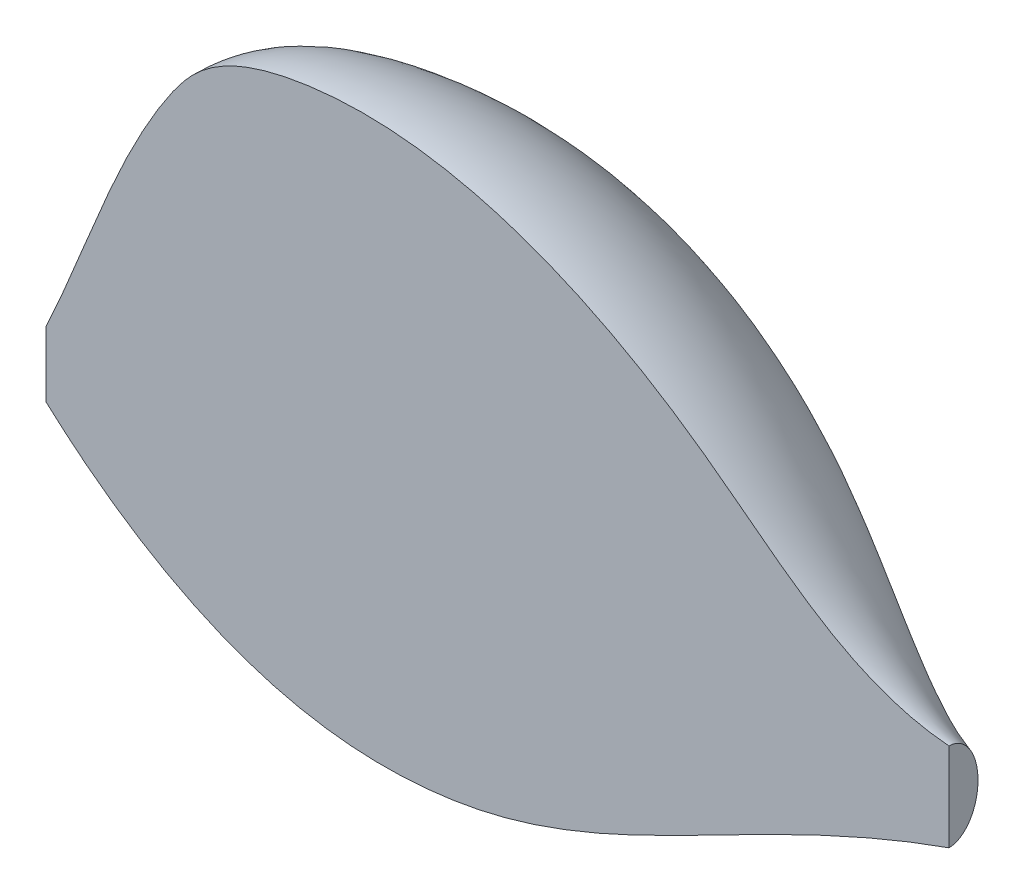
ISO-10303-21;
HEADER;
FILE_DESCRIPTION(('STEP AP214'),'2;1');
FILE_NAME('part.step','',(''),(''),'','','');
FILE_SCHEMA(('AUTOMOTIVE_DESIGN { 1 0 10303 214 1 1 1 1 }'));
ENDSEC;
DATA;
#1=APPLICATION_CONTEXT('core data for automotive mechanical design processes');
#2=APPLICATION_PROTOCOL_DEFINITION('international standard','automotive_design',2000,#1);
#3=PRODUCT_CONTEXT('',#1,'mechanical');
#4=PRODUCT('Part','Part','',(#3));
#5=PRODUCT_RELATED_PRODUCT_CATEGORY('part','',(#4));
#6=PRODUCT_DEFINITION_FORMATION('','',#4);
#7=PRODUCT_DEFINITION_CONTEXT('part definition',#1,'design');
#8=PRODUCT_DEFINITION('design','',#6,#7);
#9=PRODUCT_DEFINITION_SHAPE('','',#8);
#10=(LENGTH_UNIT() NAMED_UNIT(*) SI_UNIT(.MILLI.,.METRE.));
#11=(NAMED_UNIT(*) PLANE_ANGLE_UNIT() SI_UNIT($,.RADIAN.));
#12=(NAMED_UNIT(*) SI_UNIT($,.STERADIAN.) SOLID_ANGLE_UNIT());
#13=UNCERTAINTY_MEASURE_WITH_UNIT(LENGTH_MEASURE(1.E-05),#10,'distance_accuracy_value','');
#14=(GEOMETRIC_REPRESENTATION_CONTEXT(3) GLOBAL_UNCERTAINTY_ASSIGNED_CONTEXT((#13)) GLOBAL_UNIT_ASSIGNED_CONTEXT((#10,
#11,#12)) REPRESENTATION_CONTEXT('',''));
#15=CARTESIAN_POINT('',(0.,0.,0.));
#16=DIRECTION('',(0.,0.,1.));
#17=DIRECTION('',(1.,0.,0.));
#18=AXIS2_PLACEMENT_3D('',#15,#16,#17);
#19=CARTESIAN_POINT('',(0.,0.,0.));
#20=DIRECTION('',(0.,0.,1.));
#21=DIRECTION('',(1.,0.,0.));
#22=AXIS2_PLACEMENT_3D('',#19,#20,#21);
#23=PLANE('',#22);
#24=CARTESIAN_POINT('',(0.,0.,0.));
#25=CARTESIAN_POINT('',(2.74913465416178,5.88162986260912,0.));
#26=CARTESIAN_POINT('',(5.03717500346161,12.96739782815,0.));
#27=CARTESIAN_POINT('',(9.41436775264641,20.1420075056124,0.));
#28=CARTESIAN_POINT('',(10.7979266722041,22.0409358263714,0.));
#29=CARTESIAN_POINT('',(13.7969896713065,24.8764526689348,0.));
#30=CARTESIAN_POINT('',(19.4988240269182,26.5465685835669,0.));
#31=CARTESIAN_POINT('',(25.7105518091795,26.734565554765,0.));
#32=CARTESIAN_POINT('',(30.8570189733681,26.1375032110665,0.));
#33=CARTESIAN_POINT('',(37.3012910290402,24.6226428752955,0.));
#34=CARTESIAN_POINT('',(44.272887864184,21.4438013019915,0.));
#35=CARTESIAN_POINT('',(50.6864894568901,17.2805505945077,0.));
#36=CARTESIAN_POINT('',(58.1055816555101,11.4841674009434,0.));
#37=CARTESIAN_POINT('',(64.0144119849212,7.31487061263528,0.));
#38=CARTESIAN_POINT('',(70.,6.83884738527214,0.));
#39=B_SPLINE_CURVE_WITH_KNOTS('',3,(#24,#25,#26,#27,#28,#29,#30,#31,#32,#33,#34,#35,#36,#37,
#38),.UNSPECIFIED.,.F.,.F.,(4,1,1,1,1,1,1,1,1,1,1,1,4),(0.,0.21875,0.25,0.28125,0.296875,
0.390625,0.46875,0.501412012817861,0.5625,0.6875,0.75,0.8125,1.),.UNSPECIFIED.);
#40=CARTESIAN_POINT('',(0.,0.,0.));
#41=VERTEX_POINT('',#40);
#42=CARTESIAN_POINT('',(70.,6.83884738527214,0.));
#43=VERTEX_POINT('',#42);
#44=EDGE_CURVE('E54',#41,#43,#39,.T.);
#45=ORIENTED_EDGE('',*,*,#44,.F.);
#46=DIRECTION('',(0.,-1.,0.));
#47=VECTOR('',#46,1.);
#48=CARTESIAN_POINT('',(0.,-2.53290643898968,0.));
#49=LINE('',#48,#47);
#50=CARTESIAN_POINT('',(0.,-5.06581287797937,0.));
#51=VERTEX_POINT('',#50);
#52=EDGE_CURVE('E68',#41,#51,#49,.T.);
#53=ORIENTED_EDGE('',*,*,#52,.T.);
#54=CARTESIAN_POINT('',(70.,0.,0.));
#55=CARTESIAN_POINT('',(69.5207540377613,-0.167942416323172,0.));
#56=CARTESIAN_POINT('',(69.04310436203,-0.340383935283861,0.));
#57=CARTESIAN_POINT('',(68.0909932436031,-0.693602987996168,0.));
#58=CARTESIAN_POINT('',(67.6165312416867,-0.874379013409343,0.));
#59=CARTESIAN_POINT('',(66.1964012432734,-1.42880153287223,0.));
#60=CARTESIAN_POINT('',(65.255266067126,-1.81409153508852,0.));
#61=CARTESIAN_POINT('',(63.3840383048807,-2.61069819132023,0.));
#62=CARTESIAN_POINT('',(62.4539468575782,-3.02201750218845,0.));
#63=CARTESIAN_POINT('',(60.6030924066511,-3.86595905883859,0.));
#64=CARTESIAN_POINT('',(59.6823330468258,-4.29858926644618,0.));
#65=CARTESIAN_POINT('',(57.8487837652315,-5.18028391161377,0.));
#66=CARTESIAN_POINT('',(56.9359936083618,-5.62934786231631,0.));
#67=CARTESIAN_POINT('',(55.5720550214034,-6.31135182557194,0.));
#68=CARTESIAN_POINT('',(55.1186880010824,-6.53987886238477,0.));
#69=CARTESIAN_POINT('',(54.2131836867605,-6.99934696524036,0.));
#70=CARTESIAN_POINT('',(53.761046382183,-7.23028801043737,0.));
#71=CARTESIAN_POINT('',(52.8575132169115,-7.69349421456996,0.));
#72=CARTESIAN_POINT('',(52.4061172825027,-7.92575923012507,0.));
#73=CARTESIAN_POINT('',(51.5033541313733,-8.39035111627347,0.));
#74=CARTESIAN_POINT('',(51.0519869148511,-8.6226779872467,0.));
#75=CARTESIAN_POINT('',(49.911075319631,-9.20798420555865,0.));
#76=CARTESIAN_POINT('',(49.2211147211035,-9.56015664172984,0.));
#77=CARTESIAN_POINT('',(47.8373167077115,-10.2568725921749,0.));
#78=CARTESIAN_POINT('',(47.1434792335766,-10.6014159894127,0.));
#79=CARTESIAN_POINT('',(45.7493886971919,-11.2777063862241,0.));
#80=CARTESIAN_POINT('',(45.0491344244958,-11.6094509072914,0.));
#81=CARTESIAN_POINT('',(43.6399633735395,-12.2540422041163,0.));
#82=CARTESIAN_POINT('',(42.931047076047,-12.5668900230192,0.));
#83=CARTESIAN_POINT('',(41.6205360861372,-13.1190704049251,0.));
#84=CARTESIAN_POINT('',(41.0204747824398,-13.3620294732587,0.));
#85=CARTESIAN_POINT('',(39.8125159758704,-13.8278091960158,0.));
#86=CARTESIAN_POINT('',(39.2046180845676,-14.050628847783,0.));
#87=CARTESIAN_POINT('',(37.9808755586177,-14.4722301018851,0.));
#88=CARTESIAN_POINT('',(37.3650360174947,-14.6710263387027,0.));
#89=CARTESIAN_POINT('',(36.4350653861802,-14.9481706385443,0.));
#90=CARTESIAN_POINT('',(36.1240498783241,-15.03704125442,0.));
#91=CARTESIAN_POINT('',(35.4999583695043,-15.2072359069124,0.));
#92=CARTESIAN_POINT('',(35.1868824209709,-15.2885601347667,0.));
#93=CARTESIAN_POINT('',(34.6279912596707,-15.4260313104982,0.));
#94=CARTESIAN_POINT('',(34.3825682493245,-15.4837756384748,0.));
#95=CARTESIAN_POINT('',(33.8905982459604,-15.594240229896,0.));
#96=CARTESIAN_POINT('',(33.6440512572462,-15.6469605125608,0.));
#97=CARTESIAN_POINT('',(32.9028660097002,-15.7975814039828,0.));
#98=CARTESIAN_POINT('',(32.4066730423947,-15.8879446207975,0.));
#99=CARTESIAN_POINT('',(31.4109002133468,-16.0483247258914,0.));
#100=CARTESIAN_POINT('',(30.9113195570331,-16.118336659131,0.));
#101=CARTESIAN_POINT('',(29.9096863157605,-16.2376179397327,0.));
#102=CARTESIAN_POINT('',(29.407633778097,-16.2868876824148,0.));
#103=CARTESIAN_POINT('',(28.435788974684,-16.3615489621274,0.));
#104=CARTESIAN_POINT('',(27.9661030138248,-16.3883260418759,0.));
#105=CARTESIAN_POINT('',(27.0260280470074,-16.4227799515731,0.));
#106=CARTESIAN_POINT('',(26.5556390506514,-16.4304570400531,0.));
#107=CARTESIAN_POINT('',(25.61502835814,-16.4262635127152,0.));
#108=CARTESIAN_POINT('',(25.1448066471109,-16.4143964130142,0.));
#109=CARTESIAN_POINT('',(24.2052820444374,-16.3707606899352,0.));
#110=CARTESIAN_POINT('',(23.7359791505948,-16.3389921142274,0.));
#111=CARTESIAN_POINT('',(22.8188523765266,-16.2570340119344,0.));
#112=CARTESIAN_POINT('',(22.3709543180433,-16.2076743108373,0.));
#113=CARTESIAN_POINT('',(21.4776234428911,-16.0902702438384,0.));
#114=CARTESIAN_POINT('',(21.0321905589695,-16.0222263902499,0.));
#115=CARTESIAN_POINT('',(20.1446313109974,-15.867594929299,0.));
#116=CARTESIAN_POINT('',(19.7025044147517,-15.7810103761426,0.));
#117=CARTESIAN_POINT('',(18.8221949247994,-15.5895435383183,0.));
#118=CARTESIAN_POINT('',(18.384012688654,-15.4846596121328,0.));
#119=CARTESIAN_POINT('',(17.5087070211172,-15.2560285458278,0.));
#120=CARTESIAN_POINT('',(17.0716224372953,-15.1321323274455,0.));
#121=CARTESIAN_POINT('',(16.4200626698991,-14.9330151797095,0.));
#122=CARTESIAN_POINT('',(16.203539115086,-14.8644254636404,0.));
#123=CARTESIAN_POINT('',(15.7719221002057,-14.7228842193273,0.));
#124=CARTESIAN_POINT('',(15.5568286400011,-14.649932691503,0.));
#125=CARTESIAN_POINT('',(14.9135837128089,-14.4246888587275,0.));
#126=CARTESIAN_POINT('',(14.4876362429891,-14.2660589768729,0.));
#127=CARTESIAN_POINT('',(13.6419731085253,-13.933053290886,0.));
#128=CARTESIAN_POINT('',(13.2222573871943,-13.7586776300873,0.));
#129=CARTESIAN_POINT('',(12.3877608472906,-13.3945362183092,0.));
#130=CARTESIAN_POINT('',(11.9730032656278,-13.2047172665379,0.));
#131=CARTESIAN_POINT('',(11.1501455604505,-12.8111776681308,0.));
#132=CARTESIAN_POINT('',(10.7420454578368,-12.6074569778617,0.));
#133=CARTESIAN_POINT('',(9.93279644226536,-12.1868478961428,0.));
#134=CARTESIAN_POINT('',(9.53164611363194,-11.9699622279334,0.));
#135=CARTESIAN_POINT('',(8.73645599040318,-11.5235685576526,0.));
#136=CARTESIAN_POINT('',(8.34241611210433,-11.2940607042972,0.));
#137=CARTESIAN_POINT('',(7.23741293654132,-10.6274651562901,0.));
#138=CARTESIAN_POINT('',(6.53492946969027,-10.1762312830483,0.));
#139=CARTESIAN_POINT('',(5.15481518684846,-9.23725675006452,0.));
#140=CARTESIAN_POINT('',(4.47718686650106,-8.74951243927014,0.));
#141=CARTESIAN_POINT('',(3.15230805096635,-7.74535232933599,0.));
#142=CARTESIAN_POINT('',(2.5048542220024,-7.22920405056081,0.));
#143=CARTESIAN_POINT('',(1.23432665725474,-6.16822203519213,0.));
#144=CARTESIAN_POINT('',(0.611242781818308,-5.62340045491692,0.));
#145=CARTESIAN_POINT('',(0.,-5.06581287797937,0.));
#146=B_SPLINE_CURVE_WITH_KNOTS('',3,(#54,#55,#56,#57,#58,#59,#60,#61,#62,#63,#64,#65,#66,#67,
#68,#69,#70,#71,#72,#73,#74,#75,#76,#77,#78,#79,#80,#81,#82,#83,#84,#85,#86,#87,#88,#89,#90,#91,
#92,#93,#94,#95,#96,#97,#98,#99,#100,#101,#102,#103,#104,#105,#106,#107,#108,#109,#110,#111,
#112,#113,#114,#115,#116,#117,#118,#119,#120,#121,#122,#123,#124,#125,#126,#127,#128,#129,#130,
#131,#132,#133,#134,#135,#136,#137,#138,#139,#140,#141,#142,#143,#144,#145),.UNSPECIFIED.,.F.,
.F.,(4,2,2,2,2,2,2,2,2,2,2,2,2,2,2,2,2,2,2,2,2,2,2,2,2,2,2,2,2,2,2,2,2,2,2,2,2,2,2,2,2,2,2,2,2,
4),(0.,1.52340763460116,3.0465406442945,6.0968668432214,9.14750489754901,12.1992914555054,
15.250987675907,16.7741030020044,18.2972051863515,19.8201454453912,21.343095285754,
23.6670040562815,25.9909484529519,28.3153406461096,30.6396044094961,32.5814466758169,
34.523385565049,36.4641354441031,37.4344490845785,38.4047381290485,39.1610597523311,
39.9173784820914,41.4299837520651,42.9429569965275,44.4559014043125,45.8668757926978,
47.2778310824823,48.6885325606621,50.099230659782,51.4506723628006,52.8020770134254,
54.1532592184395,55.504562691587,56.8670613902098,57.548404881333,58.229748306917,
59.5929636367762,60.9561665585556,62.324282448265,63.6924026322665,65.060240771975,
66.4280627991113,68.931469907158,71.4351276918081,73.9182815511856,76.4003910040779),.UNSPECIFIED.);
#147=CARTESIAN_POINT('',(70.,0.,0.));
#148=VERTEX_POINT('',#147);
#149=EDGE_CURVE('E61',#148,#51,#146,.T.);
#150=ORIENTED_EDGE('',*,*,#149,.F.);
#151=DIRECTION('',(0.,-1.,0.));
#152=VECTOR('',#151,1.);
#153=CARTESIAN_POINT('',(70.,3.41942369263607,0.));
#154=LINE('',#153,#152);
#155=EDGE_CURVE('E66',#43,#148,#154,.T.);
#156=ORIENTED_EDGE('',*,*,#155,.F.);
#157=EDGE_LOOP('',(#45,#53,#150,#156));
#158=FACE_BOUND('',#157,.T.);
#159=ADVANCED_FACE('F34',(#158),#23,.T.);
#160=CARTESIAN_POINT('',(70.,3.41942369263607,0.));
#161=DIRECTION('',(1.,0.,0.));
#162=DIRECTION('',(0.,0.,-1.));
#163=AXIS2_PLACEMENT_3D('',#160,#161,#162);
#164=PLANE('',#163);
#165=CARTESIAN_POINT('',(70.,3.41942369263607,0.));
#166=DIRECTION('',(1.,0.,0.));
#167=DIRECTION('',(0.,1.,0.));
#168=AXIS2_PLACEMENT_3D('',#165,#166,#167);
#169=ELLIPSE('',#168,3.41942369263607,2.25);
#170=EDGE_CURVE('E46',#148,#43,#169,.T.);
#171=ORIENTED_EDGE('',*,*,#170,.T.);
#172=ORIENTED_EDGE('',*,*,#155,.T.);
#173=EDGE_LOOP('',(#171,#172));
#174=FACE_BOUND('',#173,.T.);
#175=ADVANCED_FACE('F72',(#174),#164,.T.);
#176=CARTESIAN_POINT('',(0.,-2.53290643898968,0.));
#177=DIRECTION('',(1.,0.,0.));
#178=DIRECTION('',(0.,0.,-1.));
#179=AXIS2_PLACEMENT_3D('',#176,#177,#178);
#180=PLANE('',#179);
#181=ORIENTED_EDGE('',*,*,#52,.F.);
#182=CARTESIAN_POINT('',(0.,-2.53290643898968,0.));
#183=DIRECTION('',(1.,0.,0.));
#184=DIRECTION('',(0.,1.,0.));
#185=AXIS2_PLACEMENT_3D('',#182,#183,#184);
#186=ELLIPSE('',#185,2.53290643898968,2.5);
#187=EDGE_CURVE('E11',#51,#41,#186,.T.);
#188=ORIENTED_EDGE('',*,*,#187,.F.);
#189=EDGE_LOOP('',(#181,#188));
#190=FACE_BOUND('',#189,.T.);
#191=ADVANCED_FACE('F108',(#190),#180,.F.);
#192=CARTESIAN_POINT('',(0.,0.,0.));
#193=CARTESIAN_POINT('',(2.74913465416178,5.88162986260912,0.));
#194=CARTESIAN_POINT('',(5.03717500346161,12.96739782815,0.));
#195=CARTESIAN_POINT('',(9.41436775264641,20.1420075056124,0.));
#196=CARTESIAN_POINT('',(10.7979266722041,22.0409358263714,0.));
#197=CARTESIAN_POINT('',(13.7969896713065,24.8764526689348,0.));
#198=CARTESIAN_POINT('',(19.4988240269182,26.5465685835669,0.));
#199=CARTESIAN_POINT('',(25.7105518091795,26.734565554765,0.));
#200=CARTESIAN_POINT('',(30.8570189733681,26.1375032110665,0.));
#201=CARTESIAN_POINT('',(37.3012910290402,24.6226428752955,0.));
#202=CARTESIAN_POINT('',(44.272887864184,21.4438013019915,0.));
#203=CARTESIAN_POINT('',(50.6864894568901,17.2805505945077,0.));
#204=CARTESIAN_POINT('',(58.1055816555101,11.4841674009434,0.));
#205=CARTESIAN_POINT('',(64.0144119849212,7.31487061263528,0.));
#206=CARTESIAN_POINT('',(70.,6.83884738527214,0.));
#207=CARTESIAN_POINT('',(0.,0.,0.164703237051049));
#208=CARTESIAN_POINT('',(2.74913465416178,5.88162986260912,0.405401155987693));
#209=CARTESIAN_POINT('',(5.03717500346162,12.96739782815,0.680484491915287));
#210=CARTESIAN_POINT('',(9.41436775264641,20.1420075056124,0.922850830308269));
#211=CARTESIAN_POINT('',(10.7979266722041,22.0409358263714,0.984849224740798));
#212=CARTESIAN_POINT('',(13.7969896713065,24.8764526689348,1.08835809725422));
#213=CARTESIAN_POINT('',(19.4988240269182,26.5465685835669,1.19980855485574));
#214=CARTESIAN_POINT('',(25.7105518091795,26.734565554765,1.26147545698781));
#215=CARTESIAN_POINT('',(30.8570189733681,26.1375032110665,1.27435452469794));
#216=CARTESIAN_POINT('',(37.3012910290402,24.6226428752955,1.24588478977698));
#217=CARTESIAN_POINT('',(44.272887864184,21.4438013019915,1.1247370279085));
#218=CARTESIAN_POINT('',(50.6864894568901,17.2805505945077,0.938632096613125));
#219=CARTESIAN_POINT('',(58.1055816555101,11.4841674009434,0.663154909805604));
#220=CARTESIAN_POINT('',(64.0144119849212,7.31487061263528,0.391357933133625));
#221=CARTESIAN_POINT('',(70.,6.83884738527214,0.18751020062964));
#222=CARTESIAN_POINT('',(0.,-0.033415958399481,0.494068960698842));
#223=CARTESIAN_POINT('',(2.75317818152251,5.77709511280238,1.21604389356127));
#224=CARTESIAN_POINT('',(5.05638749767896,12.7812103312917,2.04115810254689));
#225=CARTESIAN_POINT('',(9.44202139352032,19.8776084359985,2.76812597074791));
#226=CARTESIAN_POINT('',(10.8270126101924,21.7561243484393,2.9540864407317));
#227=CARTESIAN_POINT('',(13.8252445930119,24.5603378697504,3.2645531810931));
#228=CARTESIAN_POINT('',(19.5145068417273,26.2081678152025,3.59883327821562));
#229=CARTESIAN_POINT('',(25.7158365667288,26.3910667583709,3.7837755412602));
#230=CARTESIAN_POINT('',(30.8557394706616,25.7996045062971,3.82237618394956));
#231=CARTESIAN_POINT('',(37.293607962677,24.3021898460362,3.73693490621174));
#232=CARTESIAN_POINT('',(44.2606841472546,21.1650711625532,3.37348379075392));
#233=CARTESIAN_POINT('',(50.6753818961174,17.0574982781886,2.81518183602969));
#234=CARTESIAN_POINT('',(58.1016307148444,11.3375654487618,1.9887801335521));
#235=CARTESIAN_POINT('',(64.0185865142166,7.2244851236472,1.17342966068325));
#236=CARTESIAN_POINT('',(69.9999999999999,6.76545808223477,0.561916806031608));
#237=CARTESIAN_POINT('',(0.,-0.179639739320719,0.968612755393322));
#238=CARTESIAN_POINT('',(2.76985773188557,5.3248698565184,2.36265212374147));
#239=CARTESIAN_POINT('',(5.13563903632561,11.9777258239254,3.95583997328221));
#240=CARTESIAN_POINT('',(9.55609266212537,18.7392097986488,5.35852433078652));
#241=CARTESIAN_POINT('',(10.946992104394,20.5304241785659,5.71723411475763));
#242=CARTESIAN_POINT('',(13.9417961450466,23.2004076502383,6.31594474698964));
#243=CARTESIAN_POINT('',(19.5791984528153,24.7510685533276,6.9599883505625));
#244=CARTESIAN_POINT('',(25.7376361916203,24.9107541744159,7.31466318684443));
#245=CARTESIAN_POINT('',(30.8504615219975,24.3428525140157,7.38658079428589));
#246=CARTESIAN_POINT('',(37.2619153139294,22.9206314292607,7.21761072107231));
#247=CARTESIAN_POINT('',(44.2103438149212,19.9645246122921,6.50997752454616));
#248=CARTESIAN_POINT('',(50.6295632079305,16.0993667421189,5.42512584862319));
#249=CARTESIAN_POINT('',(58.0853330845991,10.7132473014032,3.82026190121401));
#250=CARTESIAN_POINT('',(64.0358064475606,6.84985516951221,2.23781152028013));
#251=CARTESIAN_POINT('',(70.,6.47428385705932,1.05097373457971));
#252=CARTESIAN_POINT('',(0.,-0.417815331687546,1.40426921989629));
#253=CARTESIAN_POINT('',(2.79563521881024,4.61770056404945,3.38405350355391));
#254=CARTESIAN_POINT('',(5.25811868696121,10.7321786634245,5.64666411344832));
#255=CARTESIAN_POINT('',(9.73238462269662,16.9811744899074,7.63718865445883));
#256=CARTESIAN_POINT('',(11.132414959069,18.6388922773219,8.14607147179344));
#257=CARTESIAN_POINT('',(14.1219212709182,21.1040007990971,8.99517378108387));
#258=CARTESIAN_POINT('',(19.6791763972236,22.5079474930438,9.90765737040249));
#259=CARTESIAN_POINT('',(25.7713265209978,22.6355901183971,10.4076158831785));
#260=CARTESIAN_POINT('',(30.8423046922436,22.1073607551172,10.5057144152307));
#261=CARTESIAN_POINT('',(37.2129357658646,20.8055440216792,10.2595807710879));
#262=CARTESIAN_POINT('',(44.1325451194966,18.1340431213446,9.24557436611625));
#263=CARTESIAN_POINT('',(50.5587525080048,14.6484810286321,7.6943268939177));
#264=CARTESIAN_POINT('',(58.0601458378561,9.78449231667697,5.40094663631556));
#265=CARTESIAN_POINT('',(64.0624190718192,6.31202496979851,3.14105732940911));
#266=CARTESIAN_POINT('',(70.,6.0692129668968,1.44614034922928));
#267=CARTESIAN_POINT('',(0.,-0.736275070832584,1.78533985042534));
#268=CARTESIAN_POINT('',(2.82899431953634,3.70526721762814,4.24712076908157));
#269=CARTESIAN_POINT('',(5.41662176425446,9.1378317787804,7.06058467611726));
#270=CARTESIAN_POINT('',(9.96052715990664,14.7378624068286,9.5339878891105));
#271=CARTESIAN_POINT('',(11.3723739474722,16.2265884936762,10.1661440449085));
#272=CARTESIAN_POINT('',(14.3550243749875,18.433058027961,11.2206453064815));
#273=CARTESIAN_POINT('',(19.8085596193993,19.6548441000827,12.3528317809534));
#274=CARTESIAN_POINT('',(25.8149257707806,19.7472749065178,12.9702905266957));
#275=CARTESIAN_POINT('',(30.8317487949153,19.2742457954579,13.0877210038641));
#276=CARTESIAN_POINT('',(37.1495504683693,18.1315492858929,12.7747131852626));
#277=CARTESIAN_POINT('',(44.0318644548298,15.8289296907543,11.5036459195764));
#278=CARTESIAN_POINT('',(50.4671151316308,12.8328744843602,9.56282382193981));
#279=CARTESIAN_POINT('',(58.0275505773654,8.64087884481131,6.69510619930173));
#280=CARTESIAN_POINT('',(64.096858938507,5.66950518744505,3.87090410048053));
#281=CARTESIAN_POINT('',(70.0000000000001,5.59489261976104,1.75275252636463));
#282=CARTESIAN_POINT('',(0.,-1.12335129208846,2.09612614319804));
#283=CARTESIAN_POINT('',(2.86841871130353,2.63791607432653,4.92957986670705));
#284=CARTESIAN_POINT('',(5.60394358287372,7.2893758307831,8.1678126935745));
#285=CARTESIAN_POINT('',(10.2301501584275,12.1453863613048,11.013046072369));
#286=CARTESIAN_POINT('',(11.6559618428577,13.4403737410069,11.7400729195396));
#287=CARTESIAN_POINT('',(14.6305098616148,15.3513437226682,12.952560436908));
#288=CARTESIAN_POINT('',(19.9614670637887,16.3694412927577,14.253423116791));
#289=CARTESIAN_POINT('',(25.8664521568874,16.4284812155325,14.9602145912756));
#290=CARTESIAN_POINT('',(30.8192736435272,16.0247242236427,15.0911790684053));
#291=CARTESIAN_POINT('',(37.0746405713292,15.0719033545493,14.7245067978653));
#292=CARTESIAN_POINT('',(43.9128782147688,13.2007530737919,13.2521422425347));
#293=CARTESIAN_POINT('',(50.3588164140975,10.7739550202513,11.0073218832587));
#294=CARTESIAN_POINT('',(57.9890289058761,7.36140647182271,7.6919013824873));
#295=CARTESIAN_POINT('',(64.1375605991378,4.96665784599017,4.42829091985828));
#296=CARTESIAN_POINT('',(69.9999999999999,5.07914397787338,1.98058307288651));
#297=CARTESIAN_POINT('',(0.,-1.70943086849807,2.40384629918117));
#298=CARTESIAN_POINT('',(2.9270498580342,1.06385273718192,5.58811269957258));
#299=CARTESIAN_POINT('',(5.88252474902538,4.58076333529952,9.22727430001991));
#300=CARTESIAN_POINT('',(10.6311279510995,8.3552427655249,12.4230563499191));
#301=CARTESIAN_POINT('',(12.0777079436873,9.36860121967984,13.2394819391289));
#302=CARTESIAN_POINT('',(15.0402062263425,10.8511364857773,14.6007738110176));
#303=CARTESIAN_POINT('',(20.1888678785215,11.5788291211908,16.0602625514218));
#304=CARTESIAN_POINT('',(25.943081141354,11.5969358976546,16.8503684495389));
#305=CARTESIAN_POINT('',(30.8007208542832,11.3003272854753,16.9930238315597));
#306=CARTESIAN_POINT('',(36.9632361090644,10.63144919192,16.5740442258405));
#307=CARTESIAN_POINT('',(43.7359243192935,9.39644327865077,14.9092537735808));
#308=CARTESIAN_POINT('',(50.1977567828944,7.80538623959791,12.374661737139));
#309=CARTESIAN_POINT('',(57.9317402662256,5.53493243339104,8.63285812287139));
#310=CARTESIAN_POINT('',(64.1980912739224,3.97983257943048,4.95113894899863));
#311=CARTESIAN_POINT('',(70.0000000000001,4.35714594927359,2.18984956859407));
#312=CARTESIAN_POINT('',(0.,-2.53290643898968,2.56422645962417));
#313=CARTESIAN_POINT('',(3.00792040524896,-1.08204540270122,5.9201480788607));
#314=CARTESIAN_POINT('',(6.26677463337259,0.916042550103315,9.75548707227388));
#315=CARTESIAN_POINT('',(11.1842007685783,3.24076875398407,13.1225482603303));
#316=CARTESIAN_POINT('',(12.6594267034524,3.87656481136204,13.9826291316529));
#317=CARTESIAN_POINT('',(15.6053046604499,4.78657654746232,15.4165435846433));
#318=CARTESIAN_POINT('',(20.502524174705,5.13438555570937,16.9533001800652));
#319=CARTESIAN_POINT('',(26.0487762923425,5.10982059272237,17.7835712429719));
#320=CARTESIAN_POINT('',(30.7751308001538,4.96689135649833,17.9312985997131));
#321=CARTESIAN_POINT('',(36.8095747818028,4.69058909685918,17.4857342388887));
#322=CARTESIAN_POINT('',(43.4918499807069,4.32108933985038,15.7253361820841));
#323=CARTESIAN_POINT('',(49.9756055674418,3.86137292176785,13.0472598119104));
#324=CARTESIAN_POINT('',(57.8527214529144,3.13319622316633,9.09454500362324));
#325=CARTESIAN_POINT('',(64.2815818598318,2.7022890449061,5.20622994230937));
#326=CARTESIAN_POINT('',(69.9999999999999,3.41942369263607,2.28999364632396));
#327=CARTESIAN_POINT('',(0.,-3.3563820094813,2.40384629918118));
#328=CARTESIAN_POINT('',(3.08879095246369,-3.22794354258436,5.58811269957258));
#329=CARTESIAN_POINT('',(6.65102451771972,-2.74867823509287,9.22727430001991));
#330=CARTESIAN_POINT('',(11.7372735860569,-1.87370525755672,12.4230563499191));
#331=CARTESIAN_POINT('',(13.2411454632175,-1.61547159695572,13.2394819391289));
#332=CARTESIAN_POINT('',(16.1704030945571,-1.27798339085257,14.6007738110176));
#333=CARTESIAN_POINT('',(20.8161804708882,-1.31005800977205,16.0602625514218));
#334=CARTESIAN_POINT('',(26.1544714433309,-1.37729471220984,16.8503684495389));
#335=CARTESIAN_POINT('',(30.7495407460243,-1.36654457247857,16.9930238315597));
#336=CARTESIAN_POINT('',(36.655913454541,-1.25027099820161,16.5740442258405));
#337=CARTESIAN_POINT('',(43.2477756421204,-0.754264598949965,14.9092537735808));
#338=CARTESIAN_POINT('',(49.7534543519893,-0.0826403960621696,12.374661737139));
#339=CARTESIAN_POINT('',(57.7737026396033,0.731460012941643,8.63285812287139));
#340=CARTESIAN_POINT('',(64.3650724457416,1.42474551038174,4.95113894899864));
#341=CARTESIAN_POINT('',(70.0000000000001,2.48170143599857,2.18984956859407));
#342=CARTESIAN_POINT('',(0.,-3.94246158589091,2.09612614319805));
#343=CARTESIAN_POINT('',(3.14742209919438,-4.80200687972897,4.92957986670705));
#344=CARTESIAN_POINT('',(6.92960568387144,-5.45729073057647,8.16781269357449));
#345=CARTESIAN_POINT('',(12.138251378729,-5.66384885333669,11.013046072369));
#346=CARTESIAN_POINT('',(13.6628915640472,-5.68724411828283,11.7400729195395));
#347=CARTESIAN_POINT('',(16.5800994592849,-5.77819062774358,12.952560436908));
#348=CARTESIAN_POINT('',(21.0435812856212,-6.10067018133893,14.253423116791));
#349=CARTESIAN_POINT('',(26.2311004277975,-6.20884003008772,14.9602145912756));
#350=CARTESIAN_POINT('',(30.7309879567804,-6.09094151064598,15.0911790684053));
#351=CARTESIAN_POINT('',(36.5445089922763,-5.69072516083094,14.7245067978653));
#352=CARTESIAN_POINT('',(43.0708217466451,-4.55857439409112,13.2521422425346));
#353=CARTESIAN_POINT('',(49.5923947207861,-3.05120917671555,11.0073218832587));
#354=CARTESIAN_POINT('',(57.7164139999527,-1.09501402549004,7.69190138248729));
#355=CARTESIAN_POINT('',(64.425603120526,0.437920243822027,4.42829091985828));
#356=CARTESIAN_POINT('',(70.,1.75970340739876,1.98058307288652));
#357=CARTESIAN_POINT('',(0.,-4.32953780714678,1.78533985042534));
#358=CARTESIAN_POINT('',(3.18684649096157,-5.86935802303059,4.24712076908157));
#359=CARTESIAN_POINT('',(7.1169275024907,-7.30574667857377,7.06058467611725));
#360=CARTESIAN_POINT('',(12.4078743772499,-8.25632489886042,9.53398788911048));
#361=CARTESIAN_POINT('',(13.9464794594327,-8.47345887095213,10.1661440449084));
#362=CARTESIAN_POINT('',(16.8555849459123,-8.85990493303641,11.2206453064814));
#363=CARTESIAN_POINT('',(21.1964887300106,-9.38607298866397,12.3528317809534));
#364=CARTESIAN_POINT('',(26.2826268139044,-9.52763372107312,12.9702905266957));
#365=CARTESIAN_POINT('',(30.7185128053923,-9.34046308246121,13.087721003864));
#366=CARTESIAN_POINT('',(36.4695990952362,-8.75037109217452,12.7747131852626));
#367=CARTESIAN_POINT('',(42.9518355065841,-7.18675101105356,11.5036459195764));
#368=CARTESIAN_POINT('',(49.484096003253,-5.11012864082451,9.56282382193979));
#369=CARTESIAN_POINT('',(57.6778923284635,-2.37448639847865,6.69510619930172));
#370=CARTESIAN_POINT('',(64.4663047811568,-0.264927097632851,3.87090410048053));
#371=CARTESIAN_POINT('',(69.9999999999999,1.2439547655111,1.75275252636463));
#372=CARTESIAN_POINT('',(0.,-4.64799754629182,1.40426921989629));
#373=CARTESIAN_POINT('',(3.22020559168763,-6.7817913694519,3.3840535035539));
#374=CARTESIAN_POINT('',(7.27543057978386,-8.90009356321788,5.64666411344831));
#375=CARTESIAN_POINT('',(12.6360169144598,-10.4996369819393,7.63718865445882));
#376=CARTESIAN_POINT('',(14.1864384478357,-10.8857626545978,8.14607147179342));
#377=CARTESIAN_POINT('',(17.0886880499815,-11.5308477041725,8.99517378108385));
#378=CARTESIAN_POINT('',(21.3258719521862,-12.2391763816251,9.90765737040247));
#379=CARTESIAN_POINT('',(26.3262260636871,-12.4159489329524,10.4076158831785));
#380=CARTESIAN_POINT('',(30.7079569080638,-12.1735780421206,10.5057144152306));
#381=CARTESIAN_POINT('',(36.4062137977407,-11.4243658279608,10.2595807710878));
#382=CARTESIAN_POINT('',(42.8511548419172,-9.4918644416438,9.24557436611624));
#383=CARTESIAN_POINT('',(49.3924586268788,-6.92573518509637,7.69432689391769));
#384=CARTESIAN_POINT('',(57.6452970679727,-3.51809987034431,5.40094663631555));
#385=CARTESIAN_POINT('',(64.5007446478447,-0.9074468799863,3.14105732940911));
#386=CARTESIAN_POINT('',(70.0000000000001,0.769634418375345,1.44614034922928));
#387=CARTESIAN_POINT('',(0.,-4.88617313865865,0.968612755393322));
#388=CARTESIAN_POINT('',(3.24598307861236,-7.48896066192085,2.36265212374147));
#389=CARTESIAN_POINT('',(7.39791023041959,-10.1456407237187,3.95583997328222));
#390=CARTESIAN_POINT('',(12.8123088750312,-12.2576722906807,5.35852433078654));
#391=CARTESIAN_POINT('',(14.3718613025109,-12.7772945558418,5.71723411475765));
#392=CARTESIAN_POINT('',(17.2688131758533,-13.6272545553136,6.31594474698966));
#393=CARTESIAN_POINT('',(21.4258498965947,-14.4822974419089,6.95998835056252));
#394=CARTESIAN_POINT('',(26.3599163930647,-14.6911129889711,7.31466318684446));
#395=CARTESIAN_POINT('',(30.6998000783101,-14.409069801019,7.38658079428592));
#396=CARTESIAN_POINT('',(36.3572342496762,-13.5394532355423,7.21761072107233));
#397=CARTESIAN_POINT('',(42.7733561464927,-11.3223459325913,6.50997752454619));
#398=CARTESIAN_POINT('',(49.3216479269533,-8.37662089858312,5.42512584862321));
#399=CARTESIAN_POINT('',(57.6201098212297,-4.44685485507048,3.82026190121403));
#400=CARTESIAN_POINT('',(64.5273572721032,-1.4452770797,2.23781152028014));
#401=CARTESIAN_POINT('',(69.9999999999999,0.364563528212823,1.05097373457972));
#402=CARTESIAN_POINT('',(0.,-5.03239691957989,0.494068960698842));
#403=CARTESIAN_POINT('',(3.26266262897537,-7.94118591820483,1.21604389356126));
#404=CARTESIAN_POINT('',(7.47716176906612,-10.9491252310851,2.04115810254688));
#405=CARTESIAN_POINT('',(12.9263801436361,-13.3960709280303,2.76812597074789));
#406=CARTESIAN_POINT('',(14.4918407967124,-14.0029947257152,2.95408644073168));
#407=CARTESIAN_POINT('',(17.3853647278878,-14.9871847748258,3.26455318109307));
#408=CARTESIAN_POINT('',(21.4905415076824,-15.9393967037837,3.59883327821559));
#409=CARTESIAN_POINT('',(26.381716017956,-16.1714255729261,3.78377554126017));
#410=CARTESIAN_POINT('',(30.6945221296458,-15.8658217933004,3.82237618394953));
#411=CARTESIAN_POINT('',(36.3255416009284,-14.9210116523178,3.73693490621171));
#412=CARTESIAN_POINT('',(42.7230158141592,-12.5228924828524,3.37348379075389));
#413=CARTESIAN_POINT('',(49.2758292387662,-9.33475243465283,2.81518183602967));
#414=CARTESIAN_POINT('',(57.6038121909844,-5.07117300242918,1.98878013355208));
#415=CARTESIAN_POINT('',(64.5445772054473,-1.819907033835,1.17342966068324));
#416=CARTESIAN_POINT('',(70.0000000000002,0.0733893030373738,0.561916806031607));
#417=CARTESIAN_POINT('',(0.,-5.06581287797937,0.164703237051049));
#418=CARTESIAN_POINT('',(3.26670615633612,-8.04572066801156,0.405401155987694));
#419=CARTESIAN_POINT('',(7.49637426328351,-11.1353127279434,0.680484491915288));
#420=CARTESIAN_POINT('',(12.9540337845101,-13.6604699976443,0.922850830308269));
#421=CARTESIAN_POINT('',(14.5209267347007,-14.2878062036473,0.984849224740799));
#422=CARTESIAN_POINT('',(17.4136196495932,-15.3032995740102,1.08835809725422));
#423=CARTESIAN_POINT('',(21.5062243224916,-16.2777974721481,1.19980855485574));
#424=CARTESIAN_POINT('',(26.3870007755054,-16.5149243693202,1.26147545698781));
#425=CARTESIAN_POINT('',(30.6932426269394,-16.2037204980698,1.27435452469794));
#426=CARTESIAN_POINT('',(36.3178585345653,-15.2414646815771,1.24588478977698));
#427=CARTESIAN_POINT('',(42.7108120972299,-12.8016226222907,1.1247370279085));
#428=CARTESIAN_POINT('',(49.2647216779936,-9.55780475097193,0.938632096613126));
#429=CARTESIAN_POINT('',(57.5998612503188,-5.21777495461075,0.663154909805605));
#430=CARTESIAN_POINT('',(64.5487517347426,-1.91029252282308,0.391357933133625));
#431=CARTESIAN_POINT('',(70.,0.,0.18751020062964));
#432=CARTESIAN_POINT('',(0.,-5.06581287797937,-0.164703237051048));
#433=CARTESIAN_POINT('',(3.26670615633612,-8.04572066801156,-0.405401155987692));
#434=CARTESIAN_POINT('',(7.49637426328351,-11.1353127279434,-0.680484491915285));
#435=CARTESIAN_POINT('',(12.9540337845101,-13.6604699976443,-0.922850830308266));
#436=CARTESIAN_POINT('',(14.5209267347007,-14.2878062036473,-0.984849224740796));
#437=CARTESIAN_POINT('',(17.4136196495932,-15.3032995740102,-1.08835809725421));
#438=CARTESIAN_POINT('',(21.5062243224916,-16.2777974721481,-1.19980855485574));
#439=CARTESIAN_POINT('',(26.3870007755054,-16.5149243693202,-1.26147545698781));
#440=CARTESIAN_POINT('',(30.6932426269394,-16.2037204980698,-1.27435452469793));
#441=CARTESIAN_POINT('',(36.3178585345653,-15.2414646815771,-1.24588478977698));
#442=CARTESIAN_POINT('',(42.7108120972299,-12.8016226222907,-1.1247370279085));
#443=CARTESIAN_POINT('',(49.2647216779936,-9.55780475097193,-0.938632096613123));
#444=CARTESIAN_POINT('',(57.5998612503188,-5.21777495461075,-0.663154909805602));
#445=CARTESIAN_POINT('',(64.5487517347426,-1.91029252282308,-0.391357933133623));
#446=CARTESIAN_POINT('',(70.,0.,-0.187510200629639));
#447=CARTESIAN_POINT('',(0.,-5.03239691957989,-0.494068960698843));
#448=CARTESIAN_POINT('',(3.26266262897538,-7.94118591820483,-1.21604389356127));
#449=CARTESIAN_POINT('',(7.47716176906615,-10.9491252310851,-2.04115810254689));
#450=CARTESIAN_POINT('',(12.9263801436361,-13.3960709280303,-2.76812597074791));
#451=CARTESIAN_POINT('',(14.4918407967124,-14.0029947257152,-2.9540864407317));
#452=CARTESIAN_POINT('',(17.3853647278878,-14.9871847748257,-3.2645531810931));
#453=CARTESIAN_POINT('',(21.4905415076825,-15.9393967037837,-3.59883327821562));
#454=CARTESIAN_POINT('',(26.381716017956,-16.1714255729261,-3.7837755412602));
#455=CARTESIAN_POINT('',(30.6945221296458,-15.8658217933004,-3.82237618394956));
#456=CARTESIAN_POINT('',(36.3255416009284,-14.9210116523178,-3.73693490621173));
#457=CARTESIAN_POINT('',(42.7230158141593,-12.5228924828524,-3.37348379075391));
#458=CARTESIAN_POINT('',(49.2758292387662,-9.33475243465282,-2.81518183602969));
#459=CARTESIAN_POINT('',(57.6038121909843,-5.07117300242917,-1.98878013355209));
#460=CARTESIAN_POINT('',(64.5445772054472,-1.819907033835,-1.17342966068324));
#461=CARTESIAN_POINT('',(70.,0.0733893030373731,-0.561916806031603));
#462=CARTESIAN_POINT('',(0.,-4.88617313865865,-0.968612755393323));
#463=CARTESIAN_POINT('',(3.24598307861234,-7.48896066192085,-2.36265212374146));
#464=CARTESIAN_POINT('',(7.39791023041954,-10.1456407237187,-3.9558399732822));
#465=CARTESIAN_POINT('',(12.8123088750311,-12.2576722906807,-5.3585243307865));
#466=CARTESIAN_POINT('',(14.3718613025108,-12.7772945558418,-5.71723411475761));
#467=CARTESIAN_POINT('',(17.2688131758532,-13.6272545553136,-6.31594474698962));
#468=CARTESIAN_POINT('',(21.4258498965946,-14.4822974419089,-6.95998835056247));
#469=CARTESIAN_POINT('',(26.3599163930646,-14.6911129889712,-7.3146631868444));
#470=CARTESIAN_POINT('',(30.69980007831,-14.4090698010191,-7.38658079428586));
#471=CARTESIAN_POINT('',(36.3572342496761,-13.5394532355423,-7.21761072107228));
#472=CARTESIAN_POINT('',(42.7733561464927,-11.3223459325914,-6.50997752454614));
#473=CARTESIAN_POINT('',(49.3216479269533,-8.37662089858314,-5.42512584862317));
#474=CARTESIAN_POINT('',(57.6201098212297,-4.4468548550705,-3.820261901214));
#475=CARTESIAN_POINT('',(64.5273572721033,-1.44527707970001,-2.23781152028012));
#476=CARTESIAN_POINT('',(70.,0.36456352821282,-1.05097373457971));
#477=CARTESIAN_POINT('',(0.,-4.64799754629182,-1.40426921989629));
#478=CARTESIAN_POINT('',(3.22020559168765,-6.7817913694519,-3.38405350355391));
#479=CARTESIAN_POINT('',(7.2754305797839,-8.90009356321788,-5.64666411344834));
#480=CARTESIAN_POINT('',(12.6360169144598,-10.4996369819393,-7.63718865445885));
#481=CARTESIAN_POINT('',(14.1864384478358,-10.8857626545978,-8.14607147179347));
#482=CARTESIAN_POINT('',(17.0886880499815,-11.5308477041725,-8.9951737810839));
#483=CARTESIAN_POINT('',(21.3258719521862,-12.2391763816251,-9.90765737040252));
#484=CARTESIAN_POINT('',(26.3262260636871,-12.4159489329524,-10.4076158831786));
#485=CARTESIAN_POINT('',(30.7079569080639,-12.1735780421206,-10.5057144152307));
#486=CARTESIAN_POINT('',(36.4062137977408,-11.4243658279608,-10.2595807710879));
#487=CARTESIAN_POINT('',(42.8511548419172,-9.49186444164381,-9.24557436611628));
#488=CARTESIAN_POINT('',(49.3924586268788,-6.92573518509638,-7.69432689391772));
#489=CARTESIAN_POINT('',(57.6452970679727,-3.51809987034431,-5.40094663631557));
#490=CARTESIAN_POINT('',(64.5007446478446,-0.907446879986304,-3.14105732940912));
#491=CARTESIAN_POINT('',(70.,0.769634418375342,-1.44614034922927));
#492=CARTESIAN_POINT('',(0.,-4.32953780714678,-1.78533985042534));
#493=CARTESIAN_POINT('',(3.18684649096154,-5.86935802303059,-4.24712076908156));
#494=CARTESIAN_POINT('',(7.11692750249063,-7.30574667857377,-7.06058467611725));
#495=CARTESIAN_POINT('',(12.4078743772498,-8.25632489886042,-9.53398788911048));
#496=CARTESIAN_POINT('',(13.9464794594326,-8.47345887095214,-10.1661440449084));
#497=CARTESIAN_POINT('',(16.8555849459122,-8.85990493303642,-11.2206453064814));
#498=CARTESIAN_POINT('',(21.1964887300105,-9.38607298866398,-12.3528317809534));
#499=CARTESIAN_POINT('',(26.2826268139043,-9.52763372107312,-12.9702905266957));
#500=CARTESIAN_POINT('',(30.7185128053921,-9.34046308246121,-13.087721003864));
#501=CARTESIAN_POINT('',(36.4695990952362,-8.75037109217453,-12.7747131852626));
#502=CARTESIAN_POINT('',(42.9518355065841,-7.18675101105356,-11.5036459195764));
#503=CARTESIAN_POINT('',(49.4840960032529,-5.11012864082452,-9.56282382193979));
#504=CARTESIAN_POINT('',(57.6778923284635,-2.37448639847866,-6.69510619930172));
#505=CARTESIAN_POINT('',(64.4663047811569,-0.264927097632856,-3.87090410048053));
#506=CARTESIAN_POINT('',(70.0000000000001,1.24395476551109,-1.75275252636464));
#507=CARTESIAN_POINT('',(0.,-3.94246158589091,-2.09612614319804));
#508=CARTESIAN_POINT('',(3.14742209919438,-4.80200687972897,-4.92957986670705));
#509=CARTESIAN_POINT('',(6.92960568387144,-5.45729073057647,-8.16781269357448));
#510=CARTESIAN_POINT('',(12.138251378729,-5.66384885333669,-11.013046072369));
#511=CARTESIAN_POINT('',(13.6628915640472,-5.68724411828283,-11.7400729195395));
#512=CARTESIAN_POINT('',(16.580099459285,-5.77819062774358,-12.952560436908));
#513=CARTESIAN_POINT('',(21.0435812856212,-6.10067018133894,-14.253423116791));
#514=CARTESIAN_POINT('',(26.2311004277975,-6.20884003008772,-14.9602145912756));
#515=CARTESIAN_POINT('',(30.7309879567803,-6.09094151064598,-15.0911790684053));
#516=CARTESIAN_POINT('',(36.5445089922763,-5.69072516083095,-14.7245067978653));
#517=CARTESIAN_POINT('',(43.0708217466451,-4.55857439409113,-13.2521422425346));
#518=CARTESIAN_POINT('',(49.5923947207861,-3.05120917671556,-11.0073218832587));
#519=CARTESIAN_POINT('',(57.7164139999526,-1.09501402549004,-7.69190138248729));
#520=CARTESIAN_POINT('',(64.4256031205258,0.437920243822023,-4.42829091985827));
#521=CARTESIAN_POINT('',(69.9999999999999,1.75970340739876,-1.98058307288651));
#522=CARTESIAN_POINT('',(0.,-3.3563820094813,-2.40384629918118));
#523=CARTESIAN_POINT('',(3.08879095246371,-3.22794354258436,-5.58811269957259));
#524=CARTESIAN_POINT('',(6.65102451771977,-2.74867823509287,-9.22727430001992));
#525=CARTESIAN_POINT('',(11.737273586057,-1.87370525755672,-12.4230563499191));
#526=CARTESIAN_POINT('',(13.2411454632175,-1.61547159695572,-13.2394819391289));
#527=CARTESIAN_POINT('',(16.1704030945572,-1.27798339085257,-14.6007738110176));
#528=CARTESIAN_POINT('',(20.8161804708884,-1.31005800977205,-16.0602625514218));
#529=CARTESIAN_POINT('',(26.154471443331,-1.37729471220984,-16.8503684495389));
#530=CARTESIAN_POINT('',(30.7495407460244,-1.36654457247857,-16.9930238315597));
#531=CARTESIAN_POINT('',(36.6559134545412,-1.25027099820161,-16.5740442258405));
#532=CARTESIAN_POINT('',(43.2477756421205,-0.754264598949966,-14.9092537735808));
#533=CARTESIAN_POINT('',(49.7534543519894,-0.0826403960621721,-12.3746617371391));
#534=CARTESIAN_POINT('',(57.7737026396035,0.731460012941638,-8.6328581228714));
#535=CARTESIAN_POINT('',(64.3650724457417,1.42474551038173,-4.95113894899864));
#536=CARTESIAN_POINT('',(70.0000000000002,2.48170143599856,-2.18984956859408));
#537=CARTESIAN_POINT('',(0.,-2.53290643898968,-2.56422645962416));
#538=CARTESIAN_POINT('',(3.00792040524891,-1.08204540270123,-5.92014807886069));
#539=CARTESIAN_POINT('',(6.26677463337247,0.91604255010331,-9.75548707227387));
#540=CARTESIAN_POINT('',(11.1842007685781,3.24076875398406,-13.1225482603303));
#541=CARTESIAN_POINT('',(12.6594267034522,3.87656481136203,-13.9826291316528));
#542=CARTESIAN_POINT('',(15.6053046604497,4.78657654746231,-15.4165435846433));
#543=CARTESIAN_POINT('',(20.5025241747047,5.13438555570936,-16.9533001800652));
#544=CARTESIAN_POINT('',(26.0487762923422,5.10982059272236,-17.7835712429719));
#545=CARTESIAN_POINT('',(30.7751308001535,4.96689135649832,-17.9312985997131));
#546=CARTESIAN_POINT('',(36.8095747818025,4.69058909685916,-17.4857342388886));
#547=CARTESIAN_POINT('',(43.4918499807067,4.32108933985037,-15.7253361820841));
#548=CARTESIAN_POINT('',(49.9756055674416,3.86137292176784,-13.0472598119104));
#549=CARTESIAN_POINT('',(57.8527214529142,3.13319622316632,-9.09454500362323));
#550=CARTESIAN_POINT('',(64.2815818598317,2.70228904490609,-5.20622994230936));
#551=CARTESIAN_POINT('',(69.9999999999998,3.41942369263606,-2.28999364632395));
#552=CARTESIAN_POINT('',(0.,-1.70943086849807,-2.40384629918118));
#553=CARTESIAN_POINT('',(2.92704985803423,1.06385273718192,-5.58811269957259));
#554=CARTESIAN_POINT('',(5.88252474902544,4.58076333529953,-9.22727430001992));
#555=CARTESIAN_POINT('',(10.6311279510996,8.35524276552491,-12.4230563499191));
#556=CARTESIAN_POINT('',(12.0777079436874,9.36860121967986,-13.2394819391289));
#557=CARTESIAN_POINT('',(15.0402062263427,10.8511364857773,-14.6007738110176));
#558=CARTESIAN_POINT('',(20.1888678785217,11.5788291211909,-16.0602625514218));
#559=CARTESIAN_POINT('',(25.9430811413541,11.5969358976547,-16.8503684495389));
#560=CARTESIAN_POINT('',(30.8007208542834,11.3003272854753,-16.9930238315597));
#561=CARTESIAN_POINT('',(36.9632361090646,10.63144919192,-16.5740442258405));
#562=CARTESIAN_POINT('',(43.7359243192937,9.39644327865079,-14.9092537735808));
#563=CARTESIAN_POINT('',(50.1977567828946,7.80538623959793,-12.3746617371391));
#564=CARTESIAN_POINT('',(57.9317402662258,5.53493243339105,-8.6328581228714));
#565=CARTESIAN_POINT('',(64.1980912739225,3.97983257943049,-4.95113894899865));
#566=CARTESIAN_POINT('',(70.0000000000002,4.35714594927358,-2.18984956859408));
#567=CARTESIAN_POINT('',(0.,-1.12335129208846,-2.09612614319805));
#568=CARTESIAN_POINT('',(2.86841871130352,2.63791607432653,-4.92957986670705));
#569=CARTESIAN_POINT('',(5.60394358287369,7.2893758307831,-8.16781269357448));
#570=CARTESIAN_POINT('',(10.2301501584275,12.1453863613048,-11.013046072369));
#571=CARTESIAN_POINT('',(11.6559618428576,13.4403737410069,-11.7400729195395));
#572=CARTESIAN_POINT('',(14.6305098616148,15.3513437226682,-12.952560436908));
#573=CARTESIAN_POINT('',(19.9614670637886,16.3694412927577,-14.253423116791));
#574=CARTESIAN_POINT('',(25.8664521568874,16.4284812155325,-14.9602145912756));
#575=CARTESIAN_POINT('',(30.8192736435271,16.0247242236427,-15.0911790684053));
#576=CARTESIAN_POINT('',(37.0746405713291,15.0719033545493,-14.7245067978653));
#577=CARTESIAN_POINT('',(43.9128782147687,13.2007530737919,-13.2521422425346));
#578=CARTESIAN_POINT('',(50.3588164140975,10.7739550202513,-11.0073218832587));
#579=CARTESIAN_POINT('',(57.989028905876,7.3614064718227,-7.69190138248729));
#580=CARTESIAN_POINT('',(64.1375605991377,4.96665784599017,-4.42829091985827));
#581=CARTESIAN_POINT('',(69.9999999999999,5.07914397787338,-1.98058307288651));
#582=CARTESIAN_POINT('',(0.,-0.736275070832582,-1.78533985042534));
#583=CARTESIAN_POINT('',(2.8289943195363,3.70526721762813,-4.24712076908156));
#584=CARTESIAN_POINT('',(5.41662176425438,9.13783177878039,-7.06058467611724));
#585=CARTESIAN_POINT('',(9.96052715990653,14.7378624068286,-9.53398788911047));
#586=CARTESIAN_POINT('',(11.372373947472,16.2265884936762,-10.1661440449084));
#587=CARTESIAN_POINT('',(14.3550243749874,18.433058027961,-11.2206453064814));
#588=CARTESIAN_POINT('',(19.8085596193991,19.6548441000827,-12.3528317809534));
#589=CARTESIAN_POINT('',(25.8149257707804,19.7472749065178,-12.9702905266957));
#590=CARTESIAN_POINT('',(30.8317487949151,19.2742457954578,-13.087721003864));
#591=CARTESIAN_POINT('',(37.1495504683691,18.1315492858929,-12.7747131852625));
#592=CARTESIAN_POINT('',(44.0318644548297,15.8289296907543,-11.5036459195764));
#593=CARTESIAN_POINT('',(50.4671151316307,12.8328744843602,-9.56282382193978));
#594=CARTESIAN_POINT('',(58.0275505773654,8.64087884481131,-6.69510619930172));
#595=CARTESIAN_POINT('',(64.0968589385071,5.66950518744505,-3.87090410048053));
#596=CARTESIAN_POINT('',(70.0000000000001,5.59489261976104,-1.75275252636464));
#597=CARTESIAN_POINT('',(0.,-0.417815331687545,-1.40426921989629));
#598=CARTESIAN_POINT('',(2.79563521881028,4.61770056404946,-3.3840535035539));
#599=CARTESIAN_POINT('',(5.25811868696129,10.7321786634245,-5.64666411344832));
#600=CARTESIAN_POINT('',(9.73238462269673,16.9811744899074,-7.63718865445883));
#601=CARTESIAN_POINT('',(11.1324149590691,18.6388922773219,-8.14607147179344));
#602=CARTESIAN_POINT('',(14.1219212709183,21.1040007990972,-8.99517378108387));
#603=CARTESIAN_POINT('',(19.6791763972237,22.5079474930438,-9.90765737040249));
#604=CARTESIAN_POINT('',(25.7713265209979,22.6355901183972,-10.4076158831785));
#605=CARTESIAN_POINT('',(30.8423046922437,22.1073607551173,-10.5057144152307));
#606=CARTESIAN_POINT('',(37.2129357658648,20.8055440216792,-10.2595807710879));
#607=CARTESIAN_POINT('',(44.1325451194967,18.1340431213446,-9.24557436611625));
#608=CARTESIAN_POINT('',(50.5587525080049,14.6484810286321,-7.6943268939177));
#609=CARTESIAN_POINT('',(58.0601458378561,9.78449231667698,-5.40094663631556));
#610=CARTESIAN_POINT('',(64.0624190718191,6.3120249697985,-3.14105732940911));
#611=CARTESIAN_POINT('',(69.9999999999998,6.06921296689679,-1.44614034922928));
#612=CARTESIAN_POINT('',(0.,-0.179639739320719,-0.968612755393322));
#613=CARTESIAN_POINT('',(2.76985773188554,5.3248698565184,-2.36265212374148));
#614=CARTESIAN_POINT('',(5.13563903632555,11.9777258239254,-3.95583997328222));
#615=CARTESIAN_POINT('',(9.5560926621253,18.7392097986488,-5.35852433078653));
#616=CARTESIAN_POINT('',(10.9469921043939,20.5304241785659,-5.71723411475765));
#617=CARTESIAN_POINT('',(13.9417961450465,23.2004076502382,-6.31594474698966));
#618=CARTESIAN_POINT('',(19.5791984528151,24.7510685533276,-6.95998835056252));
#619=CARTESIAN_POINT('',(25.7376361916202,24.9107541744159,-7.31466318684445));
#620=CARTESIAN_POINT('',(30.8504615219974,24.3428525140157,-7.38658079428591));
#621=CARTESIAN_POINT('',(37.2619153139293,22.9206314292607,-7.21761072107233));
#622=CARTESIAN_POINT('',(44.2103438149212,19.9645246122921,-6.50997752454618));
#623=CARTESIAN_POINT('',(50.6295632079304,16.0993667421188,-5.42512584862321));
#624=CARTESIAN_POINT('',(58.0853330845992,10.7132473014032,-3.82026190121403));
#625=CARTESIAN_POINT('',(64.0358064475606,6.84985516951221,-2.23781152028014));
#626=CARTESIAN_POINT('',(70.0000000000001,6.47428385705932,-1.05097373457972));
#627=CARTESIAN_POINT('',(0.,-0.0334159583994815,-0.494068960698843));
#628=CARTESIAN_POINT('',(2.75317818152252,5.77709511280239,-1.21604389356126));
#629=CARTESIAN_POINT('',(5.05638749767898,12.7812103312917,-2.04115810254688));
#630=CARTESIAN_POINT('',(9.44202139352036,19.8776084359985,-2.76812597074789));
#631=CARTESIAN_POINT('',(10.8270126101924,21.7561243484393,-2.95408644073168));
#632=CARTESIAN_POINT('',(13.8252445930119,24.5603378697504,-3.26455318109307));
#633=CARTESIAN_POINT('',(19.5145068417274,26.2081678152025,-3.59883327821559));
#634=CARTESIAN_POINT('',(25.7158365667289,26.3910667583709,-3.78377554126017));
#635=CARTESIAN_POINT('',(30.8557394706616,25.7996045062971,-3.82237618394953));
#636=CARTESIAN_POINT('',(37.2936079626771,24.3021898460362,-3.7369349062117));
#637=CARTESIAN_POINT('',(44.2606841472546,21.1650711625532,-3.37348379075388));
#638=CARTESIAN_POINT('',(50.6753818961175,17.0574982781886,-2.81518183602967));
#639=CARTESIAN_POINT('',(58.1016307148445,11.3375654487619,-1.98878013355208));
#640=CARTESIAN_POINT('',(64.0185865142166,7.2244851236472,-1.17342966068324));
#641=CARTESIAN_POINT('',(69.9999999999999,6.76545808223477,-0.561916806031609));
#642=CARTESIAN_POINT('',(0.,0.,-0.164703237051049));
#643=CARTESIAN_POINT('',(2.74913465416178,5.88162986260912,-0.405401155987693));
#644=CARTESIAN_POINT('',(5.03717500346161,12.96739782815,-0.680484491915287));
#645=CARTESIAN_POINT('',(9.41436775264641,20.1420075056124,-0.922850830308269));
#646=CARTESIAN_POINT('',(10.7979266722041,22.0409358263714,-0.984849224740799));
#647=CARTESIAN_POINT('',(13.7969896713065,24.8764526689348,-1.08835809725422));
#648=CARTESIAN_POINT('',(19.4988240269182,26.5465685835669,-1.19980855485574));
#649=CARTESIAN_POINT('',(25.7105518091795,26.734565554765,-1.26147545698781));
#650=CARTESIAN_POINT('',(30.8570189733681,26.1375032110665,-1.27435452469794));
#651=CARTESIAN_POINT('',(37.3012910290402,24.6226428752955,-1.24588478977698));
#652=CARTESIAN_POINT('',(44.272887864184,21.4438013019915,-1.1247370279085));
#653=CARTESIAN_POINT('',(50.6864894568901,17.2805505945077,-0.938632096613125));
#654=CARTESIAN_POINT('',(58.1055816555101,11.4841674009434,-0.663154909805604));
#655=CARTESIAN_POINT('',(64.0144119849212,7.31487061263528,-0.391357933133625));
#656=CARTESIAN_POINT('',(70.,6.83884738527214,-0.18751020062964));
#657=CARTESIAN_POINT('',(0.,0.,0.));
#658=CARTESIAN_POINT('',(2.74913465416178,5.88162986260912,0.));
#659=CARTESIAN_POINT('',(5.03717500346161,12.96739782815,0.));
#660=CARTESIAN_POINT('',(9.41436775264641,20.1420075056124,0.));
#661=CARTESIAN_POINT('',(10.7979266722041,22.0409358263714,0.));
#662=CARTESIAN_POINT('',(13.7969896713065,24.8764526689348,0.));
#663=CARTESIAN_POINT('',(19.4988240269182,26.5465685835669,0.));
#664=CARTESIAN_POINT('',(25.7105518091795,26.734565554765,0.));
#665=CARTESIAN_POINT('',(30.8570189733681,26.1375032110665,0.));
#666=CARTESIAN_POINT('',(37.3012910290402,24.6226428752955,0.));
#667=CARTESIAN_POINT('',(44.272887864184,21.4438013019915,0.));
#668=CARTESIAN_POINT('',(50.6864894568901,17.2805505945077,0.));
#669=CARTESIAN_POINT('',(58.1055816555101,11.4841674009434,0.));
#670=CARTESIAN_POINT('',(64.0144119849212,7.31487061263528,0.));
#671=CARTESIAN_POINT('',(70.,6.83884738527214,0.));
#672=B_SPLINE_SURFACE_WITH_KNOTS('',3,3,((#192,#193,#194,#195,#196,#197,#198,#199,#200,#201,
#202,#203,#204,#205,#206),(#207,#208,#209,#210,#211,#212,#213,#214,#215,#216,#217,#218,#219,
#220,#221),(#222,#223,#224,#225,#226,#227,#228,#229,#230,#231,#232,#233,#234,#235,#236),(#237,
#238,#239,#240,#241,#242,#243,#244,#245,#246,#247,#248,#249,#250,#251),(#252,#253,#254,#255,
#256,#257,#258,#259,#260,#261,#262,#263,#264,#265,#266),(#267,#268,#269,#270,#271,#272,#273,
#274,#275,#276,#277,#278,#279,#280,#281),(#282,#283,#284,#285,#286,#287,#288,#289,#290,#291,
#292,#293,#294,#295,#296),(#297,#298,#299,#300,#301,#302,#303,#304,#305,#306,#307,#308,#309,
#310,#311),(#312,#313,#314,#315,#316,#317,#318,#319,#320,#321,#322,#323,#324,#325,#326),(#327,
#328,#329,#330,#331,#332,#333,#334,#335,#336,#337,#338,#339,#340,#341),(#342,#343,#344,#345,
#346,#347,#348,#349,#350,#351,#352,#353,#354,#355,#356),(#357,#358,#359,#360,#361,#362,#363,
#364,#365,#366,#367,#368,#369,#370,#371),(#372,#373,#374,#375,#376,#377,#378,#379,#380,#381,
#382,#383,#384,#385,#386),(#387,#388,#389,#390,#391,#392,#393,#394,#395,#396,#397,#398,#399,
#400,#401),(#402,#403,#404,#405,#406,#407,#408,#409,#410,#411,#412,#413,#414,#415,#416),(#417,
#418,#419,#420,#421,#422,#423,#424,#425,#426,#427,#428,#429,#430,#431),(#432,#433,#434,#435,
#436,#437,#438,#439,#440,#441,#442,#443,#444,#445,#446),(#447,#448,#449,#450,#451,#452,#453,
#454,#455,#456,#457,#458,#459,#460,#461),(#462,#463,#464,#465,#466,#467,#468,#469,#470,#471,
#472,#473,#474,#475,#476),(#477,#478,#479,#480,#481,#482,#483,#484,#485,#486,#487,#488,#489,
#490,#491),(#492,#493,#494,#495,#496,#497,#498,#499,#500,#501,#502,#503,#504,#505,#506),(#507,
#508,#509,#510,#511,#512,#513,#514,#515,#516,#517,#518,#519,#520,#521),(#522,#523,#524,#525,
#526,#527,#528,#529,#530,#531,#532,#533,#534,#535,#536),(#537,#538,#539,#540,#541,#542,#543,
#544,#545,#546,#547,#548,#549,#550,#551),(#552,#553,#554,#555,#556,#557,#558,#559,#560,#561,
#562,#563,#564,#565,#566),(#567,#568,#569,#570,#571,#572,#573,#574,#575,#576,#577,#578,#579,
#580,#581),(#582,#583,#584,#585,#586,#587,#588,#589,#590,#591,#592,#593,#594,#595,#596),(#597,
#598,#599,#600,#601,#602,#603,#604,#605,#606,#607,#608,#609,#610,#611),(#612,#613,#614,#615,
#616,#617,#618,#619,#620,#621,#622,#623,#624,#625,#626),(#627,#628,#629,#630,#631,#632,#633,
#634,#635,#636,#637,#638,#639,#640,#641),(#642,#643,#644,#645,#646,#647,#648,#649,#650,#651,
#652,#653,#654,#655,#656),(#657,#658,#659,#660,#661,#662,#663,#664,#665,#666,#667,#668,#669,
#670,#671)),.UNSPECIFIED.,.T.,.F.,.F.,(4,1,1,1,1,1,1,1,1,1,1,1,1,1,2,1,1,1,1,1,1,1,1,1,1,1,1,1,
4),(4,1,1,1,1,1,1,1,1,1,1,1,4),(0.,0.03125,0.0625,0.09375,0.125,0.15625,0.1875,0.25,0.3125,
0.34375,0.375,0.40625,0.4375,0.46875,0.5,0.53125,0.5625,0.59375,0.625,0.65625,0.6875,0.75,
0.8125,0.84375,0.875,0.90625,0.9375,0.96875,1.),(0.,0.21875,0.25,0.28125,0.296875,0.390625,
0.46875,0.501412012817861,0.5625,0.6875,0.75,0.8125,1.),.UNSPECIFIED.);
#673=ORIENTED_EDGE('',*,*,#187,.T.);
#674=ORIENTED_EDGE('',*,*,#44,.T.);
#675=ORIENTED_EDGE('',*,*,#170,.F.);
#676=ORIENTED_EDGE('',*,*,#149,.T.);
#677=EDGE_LOOP('',(#673,#674,#675,#676));
#678=FACE_BOUND('',#677,.T.);
#679=ADVANCED_FACE('F36',(#678),#672,.T.);
#680=CLOSED_SHELL('',(#159,#175,#191,#679));
#681=MANIFOLD_SOLID_BREP('B2',#680);
#682=ADVANCED_BREP_SHAPE_REPRESENTATION('',(#18,#681),#14);
#683=SHAPE_DEFINITION_REPRESENTATION(#9,#682);
ENDSEC;
END-ISO-10303-21;
